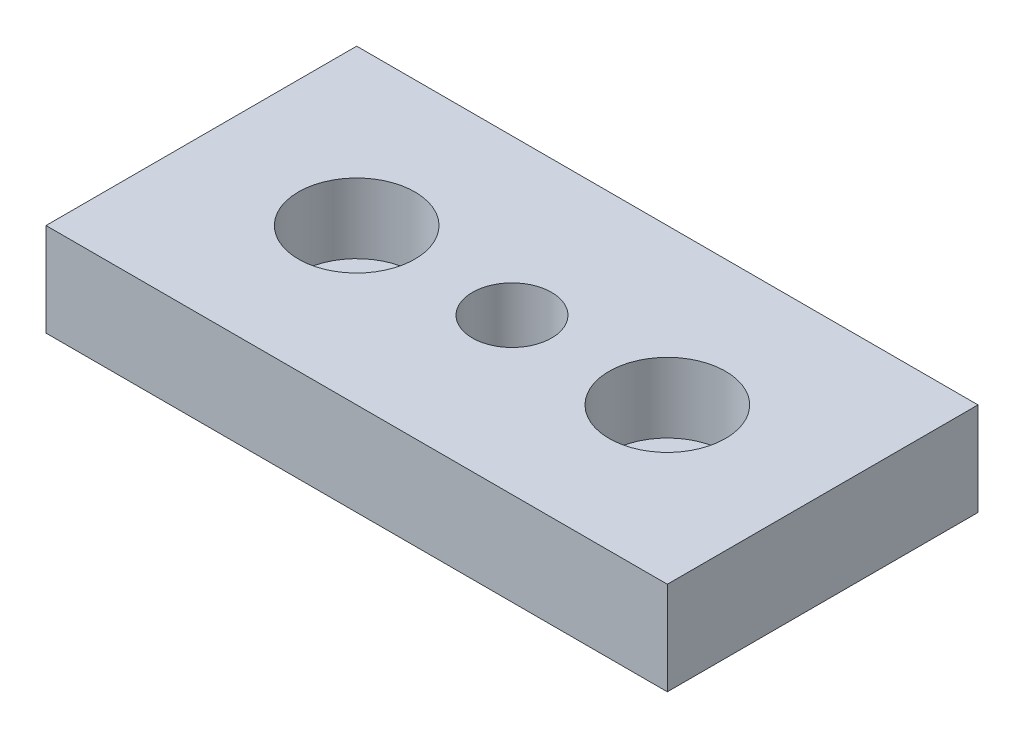
ISO-10303-21;
HEADER;
FILE_DESCRIPTION(('STEP AP214'),'2;1');
FILE_NAME('part.step','',(''),(''),'','','');
FILE_SCHEMA(('AUTOMOTIVE_DESIGN { 1 0 10303 214 1 1 1 1 }'));
ENDSEC;
DATA;
#1=APPLICATION_CONTEXT('core data for automotive mechanical design processes');
#2=APPLICATION_PROTOCOL_DEFINITION('international standard','automotive_design',2000,#1);
#3=PRODUCT_CONTEXT('',#1,'mechanical');
#4=PRODUCT('Part','Part','',(#3));
#5=PRODUCT_RELATED_PRODUCT_CATEGORY('part','',(#4));
#6=PRODUCT_DEFINITION_FORMATION('','',#4);
#7=PRODUCT_DEFINITION_CONTEXT('part definition',#1,'design');
#8=PRODUCT_DEFINITION('design','',#6,#7);
#9=PRODUCT_DEFINITION_SHAPE('','',#8);
#10=(LENGTH_UNIT() NAMED_UNIT(*) SI_UNIT(.MILLI.,.METRE.));
#11=(NAMED_UNIT(*) PLANE_ANGLE_UNIT() SI_UNIT($,.RADIAN.));
#12=(NAMED_UNIT(*) SI_UNIT($,.STERADIAN.) SOLID_ANGLE_UNIT());
#13=UNCERTAINTY_MEASURE_WITH_UNIT(LENGTH_MEASURE(1.E-05),#10,'distance_accuracy_value','');
#14=(GEOMETRIC_REPRESENTATION_CONTEXT(3) GLOBAL_UNCERTAINTY_ASSIGNED_CONTEXT((#13)) GLOBAL_UNIT_ASSIGNED_CONTEXT((#10,
#11,#12)) REPRESENTATION_CONTEXT('',''));
#15=CARTESIAN_POINT('',(0.,0.,0.));
#16=DIRECTION('',(0.,0.,1.));
#17=DIRECTION('',(1.,0.,0.));
#18=AXIS2_PLACEMENT_3D('',#15,#16,#17);
#19=CARTESIAN_POINT('',(40.,12.,20.));
#20=DIRECTION('',(-1.,0.,0.));
#21=DIRECTION('',(0.,0.,1.));
#22=AXIS2_PLACEMENT_3D('',#19,#20,#21);
#23=PLANE('',#22);
#24=DIRECTION('',(0.,0.,-1.));
#25=VECTOR('',#24,1.);
#26=CARTESIAN_POINT('',(40.,0.,20.));
#27=LINE('',#26,#25);
#28=CARTESIAN_POINT('',(40.,0.,20.));
#29=VERTEX_POINT('',#28);
#30=CARTESIAN_POINT('',(40.,0.,-20.));
#31=VERTEX_POINT('',#30);
#32=EDGE_CURVE('E100',#29,#31,#27,.T.);
#33=ORIENTED_EDGE('',*,*,#32,.T.);
#34=DIRECTION('',(0.,-1.,0.));
#35=VECTOR('',#34,1.);
#36=CARTESIAN_POINT('',(40.,12.,-20.));
#37=LINE('',#36,#35);
#38=CARTESIAN_POINT('',(40.,12.,-20.));
#39=VERTEX_POINT('',#38);
#40=EDGE_CURVE('E11',#39,#31,#37,.T.);
#41=ORIENTED_EDGE('',*,*,#40,.F.);
#42=DIRECTION('',(0.,0.,-1.));
#43=VECTOR('',#42,1.);
#44=CARTESIAN_POINT('',(40.,12.,20.));
#45=LINE('',#44,#43);
#46=CARTESIAN_POINT('',(40.,12.,20.));
#47=VERTEX_POINT('',#46);
#48=EDGE_CURVE('E88',#47,#39,#45,.T.);
#49=ORIENTED_EDGE('',*,*,#48,.F.);
#50=DIRECTION('',(0.,-1.,0.));
#51=VECTOR('',#50,1.);
#52=CARTESIAN_POINT('',(40.,12.,20.));
#53=LINE('',#52,#51);
#54=EDGE_CURVE('E96',#47,#29,#53,.T.);
#55=ORIENTED_EDGE('',*,*,#54,.T.);
#56=EDGE_LOOP('',(#33,#41,#49,#55));
#57=FACE_BOUND('',#56,.T.);
#58=ADVANCED_FACE('F37',(#57),#23,.F.);
#59=CARTESIAN_POINT('',(-40.,12.,-20.));
#60=DIRECTION('',(0.,0.,1.));
#61=DIRECTION('',(1.,0.,0.));
#62=AXIS2_PLACEMENT_3D('',#59,#60,#61);
#63=PLANE('',#62);
#64=DIRECTION('',(-1.,0.,0.));
#65=VECTOR('',#64,1.);
#66=CARTESIAN_POINT('',(-40.,0.,-20.));
#67=LINE('',#66,#65);
#68=CARTESIAN_POINT('',(-40.,0.,-20.));
#69=VERTEX_POINT('',#68);
#70=EDGE_CURVE('E92',#31,#69,#67,.T.);
#71=ORIENTED_EDGE('',*,*,#70,.T.);
#72=DIRECTION('',(0.,-1.,0.));
#73=VECTOR('',#72,1.);
#74=CARTESIAN_POINT('',(-40.,12.,-20.));
#75=LINE('',#74,#73);
#76=CARTESIAN_POINT('',(-40.,12.,-20.));
#77=VERTEX_POINT('',#76);
#78=EDGE_CURVE('E45',#77,#69,#75,.T.);
#79=ORIENTED_EDGE('',*,*,#78,.F.);
#80=DIRECTION('',(-1.,0.,0.));
#81=VECTOR('',#80,1.);
#82=CARTESIAN_POINT('',(-40.,12.,-20.));
#83=LINE('',#82,#81);
#84=EDGE_CURVE('E83',#39,#77,#83,.T.);
#85=ORIENTED_EDGE('',*,*,#84,.F.);
#86=ORIENTED_EDGE('',*,*,#40,.T.);
#87=EDGE_LOOP('',(#71,#79,#85,#86));
#88=FACE_BOUND('',#87,.T.);
#89=ADVANCED_FACE('F91',(#88),#63,.F.);
#90=CARTESIAN_POINT('',(-40.,12.,20.));
#91=DIRECTION('',(1.,0.,0.));
#92=DIRECTION('',(0.,0.,-1.));
#93=AXIS2_PLACEMENT_3D('',#90,#91,#92);
#94=PLANE('',#93);
#95=DIRECTION('',(0.,0.,1.));
#96=VECTOR('',#95,1.);
#97=CARTESIAN_POINT('',(-40.,0.,20.));
#98=LINE('',#97,#96);
#99=CARTESIAN_POINT('',(-40.,0.,20.));
#100=VERTEX_POINT('',#99);
#101=EDGE_CURVE('E70',#69,#100,#98,.T.);
#102=ORIENTED_EDGE('',*,*,#101,.T.);
#103=DIRECTION('',(0.,-1.,0.));
#104=VECTOR('',#103,1.);
#105=CARTESIAN_POINT('',(-40.,12.,20.));
#106=LINE('',#105,#104);
#107=CARTESIAN_POINT('',(-40.,12.,20.));
#108=VERTEX_POINT('',#107);
#109=EDGE_CURVE('E93',#108,#100,#106,.T.);
#110=ORIENTED_EDGE('',*,*,#109,.F.);
#111=DIRECTION('',(0.,0.,1.));
#112=VECTOR('',#111,1.);
#113=CARTESIAN_POINT('',(-40.,12.,20.));
#114=LINE('',#113,#112);
#115=EDGE_CURVE('E86',#77,#108,#114,.T.);
#116=ORIENTED_EDGE('',*,*,#115,.F.);
#117=ORIENTED_EDGE('',*,*,#78,.T.);
#118=EDGE_LOOP('',(#102,#110,#116,#117));
#119=FACE_BOUND('',#118,.T.);
#120=ADVANCED_FACE('F94',(#119),#94,.F.);
#121=CARTESIAN_POINT('',(-40.,12.,20.));
#122=DIRECTION('',(0.,0.,-1.));
#123=DIRECTION('',(-1.,0.,0.));
#124=AXIS2_PLACEMENT_3D('',#121,#122,#123);
#125=PLANE('',#124);
#126=DIRECTION('',(1.,0.,0.));
#127=VECTOR('',#126,1.);
#128=CARTESIAN_POINT('',(-40.,0.,20.));
#129=LINE('',#128,#127);
#130=EDGE_CURVE('E76',#100,#29,#129,.T.);
#131=ORIENTED_EDGE('',*,*,#130,.T.);
#132=ORIENTED_EDGE('',*,*,#54,.F.);
#133=DIRECTION('',(1.,0.,0.));
#134=VECTOR('',#133,1.);
#135=CARTESIAN_POINT('',(-40.,12.,20.));
#136=LINE('',#135,#134);
#137=EDGE_CURVE('E53',#108,#47,#136,.T.);
#138=ORIENTED_EDGE('',*,*,#137,.F.);
#139=ORIENTED_EDGE('',*,*,#109,.T.);
#140=EDGE_LOOP('',(#131,#132,#138,#139));
#141=FACE_BOUND('',#140,.T.);
#142=ADVANCED_FACE('F108',(#141),#125,.F.);
#143=CARTESIAN_POINT('',(0.,12.,0.));
#144=DIRECTION('',(0.,-1.,0.));
#145=DIRECTION('',(0.,0.,-1.));
#146=AXIS2_PLACEMENT_3D('',#143,#144,#145);
#147=PLANE('',#146);
#148=CARTESIAN_POINT('',(0.,12.,0.));
#149=DIRECTION('',(0.,1.,0.));
#150=DIRECTION('',(0.,0.,1.));
#151=AXIS2_PLACEMENT_3D('',#148,#149,#150);
#152=CIRCLE('',#151,5.1);
#153=CARTESIAN_POINT('',(0.,12.,5.1));
#154=VERTEX_POINT('',#153);
#155=EDGE_CURVE('E140',#154,#154,#152,.T.);
#156=ORIENTED_EDGE('',*,*,#155,.F.);
#157=EDGE_LOOP('',(#156));
#158=FACE_BOUND('',#157,.T.);
#159=CARTESIAN_POINT('',(20.,12.,0.));
#160=DIRECTION('',(0.,-1.,0.));
#161=DIRECTION('',(1.,0.,0.));
#162=AXIS2_PLACEMENT_3D('',#159,#160,#161);
#163=CIRCLE('',#162,7.5);
#164=CARTESIAN_POINT('',(27.5,12.,0.));
#165=VERTEX_POINT('',#164);
#166=EDGE_CURVE('E125',#165,#165,#163,.T.);
#167=ORIENTED_EDGE('',*,*,#166,.T.);
#168=EDGE_LOOP('',(#167));
#169=FACE_BOUND('',#168,.T.);
#170=CARTESIAN_POINT('',(-20.,12.,0.));
#171=DIRECTION('',(0.,1.,0.));
#172=DIRECTION('',(-1.,0.,0.));
#173=AXIS2_PLACEMENT_3D('',#170,#171,#172);
#174=CIRCLE('',#173,7.5);
#175=CARTESIAN_POINT('',(-27.5,12.,0.));
#176=VERTEX_POINT('',#175);
#177=EDGE_CURVE('E103',#176,#176,#174,.T.);
#178=ORIENTED_EDGE('',*,*,#177,.F.);
#179=EDGE_LOOP('',(#178));
#180=FACE_BOUND('',#179,.T.);
#181=ORIENTED_EDGE('',*,*,#48,.T.);
#182=ORIENTED_EDGE('',*,*,#84,.T.);
#183=ORIENTED_EDGE('',*,*,#115,.T.);
#184=ORIENTED_EDGE('',*,*,#137,.T.);
#185=EDGE_LOOP('',(#181,#182,#183,#184));
#186=FACE_BOUND('',#185,.T.);
#187=ADVANCED_FACE('F84',(#158,#169,#180,#186),#147,.F.);
#188=CARTESIAN_POINT('',(0.,0.,0.));
#189=DIRECTION('',(0.,-1.,0.));
#190=DIRECTION('',(0.,0.,-1.));
#191=AXIS2_PLACEMENT_3D('',#188,#189,#190);
#192=PLANE('',#191);
#193=CARTESIAN_POINT('',(0.,0.,0.));
#194=DIRECTION('',(0.,-1.,0.));
#195=DIRECTION('',(0.,0.,-1.));
#196=AXIS2_PLACEMENT_3D('',#193,#194,#195);
#197=CIRCLE('',#196,5.1);
#198=CARTESIAN_POINT('',(0.,0.,-5.1));
#199=VERTEX_POINT('',#198);
#200=EDGE_CURVE('E137',#199,#199,#197,.T.);
#201=ORIENTED_EDGE('',*,*,#200,.F.);
#202=EDGE_LOOP('',(#201));
#203=FACE_BOUND('',#202,.T.);
#204=CARTESIAN_POINT('',(20.,0.,0.));
#205=DIRECTION('',(0.,-1.,0.));
#206=DIRECTION('',(1.,0.,0.));
#207=AXIS2_PLACEMENT_3D('',#204,#205,#206);
#208=CIRCLE('',#207,4.5);
#209=CARTESIAN_POINT('',(24.5,0.,0.));
#210=VERTEX_POINT('',#209);
#211=EDGE_CURVE('E134',#210,#210,#208,.T.);
#212=ORIENTED_EDGE('',*,*,#211,.F.);
#213=EDGE_LOOP('',(#212));
#214=FACE_BOUND('',#213,.T.);
#215=CARTESIAN_POINT('',(-20.,0.,0.));
#216=DIRECTION('',(0.,1.,0.));
#217=DIRECTION('',(-1.,0.,0.));
#218=AXIS2_PLACEMENT_3D('',#215,#216,#217);
#219=CIRCLE('',#218,4.5);
#220=CARTESIAN_POINT('',(-24.5,0.,0.));
#221=VERTEX_POINT('',#220);
#222=EDGE_CURVE('E122',#221,#221,#219,.T.);
#223=ORIENTED_EDGE('',*,*,#222,.T.);
#224=EDGE_LOOP('',(#223));
#225=FACE_BOUND('',#224,.T.);
#226=ORIENTED_EDGE('',*,*,#32,.F.);
#227=ORIENTED_EDGE('',*,*,#130,.F.);
#228=ORIENTED_EDGE('',*,*,#101,.F.);
#229=ORIENTED_EDGE('',*,*,#70,.F.);
#230=EDGE_LOOP('',(#226,#227,#228,#229));
#231=FACE_BOUND('',#230,.T.);
#232=ADVANCED_FACE('F111',(#203,#214,#225,#231),#192,.T.);
#233=CARTESIAN_POINT('',(-20.,12.,0.));
#234=DIRECTION('',(0.,1.,0.));
#235=DIRECTION('',(-1.,0.,0.));
#236=AXIS2_PLACEMENT_3D('',#233,#234,#235);
#237=CYLINDRICAL_SURFACE('',#236,7.5);
#238=CARTESIAN_POINT('',(-20.,3.,0.));
#239=DIRECTION('',(0.,1.,0.));
#240=DIRECTION('',(-1.,0.,0.));
#241=AXIS2_PLACEMENT_3D('',#238,#239,#240);
#242=CIRCLE('',#241,7.5);
#243=CARTESIAN_POINT('',(-27.5,3.,0.));
#244=VERTEX_POINT('',#243);
#245=EDGE_CURVE('E116',#244,#244,#242,.T.);
#246=ORIENTED_EDGE('',*,*,#245,.F.);
#247=EDGE_LOOP('',(#246));
#248=FACE_BOUND('',#247,.T.);
#249=ORIENTED_EDGE('',*,*,#177,.T.);
#250=EDGE_LOOP('',(#249));
#251=FACE_BOUND('',#250,.T.);
#252=ADVANCED_FACE('F154',(#248,#251),#237,.F.);
#253=CARTESIAN_POINT('',(-27.5,3.,0.));
#254=DIRECTION('',(0.,-1.,0.));
#255=DIRECTION('',(1.,0.,0.));
#256=AXIS2_PLACEMENT_3D('',#253,#254,#255);
#257=PLANE('',#256);
#258=CARTESIAN_POINT('',(-20.,3.,0.));
#259=DIRECTION('',(0.,1.,0.));
#260=DIRECTION('',(-1.,0.,0.));
#261=AXIS2_PLACEMENT_3D('',#258,#259,#260);
#262=CIRCLE('',#261,4.5);
#263=CARTESIAN_POINT('',(-24.5,3.,0.));
#264=VERTEX_POINT('',#263);
#265=EDGE_CURVE('E119',#264,#264,#262,.T.);
#266=ORIENTED_EDGE('',*,*,#265,.F.);
#267=EDGE_LOOP('',(#266));
#268=FACE_BOUND('',#267,.T.);
#269=ORIENTED_EDGE('',*,*,#245,.T.);
#270=EDGE_LOOP('',(#269));
#271=FACE_BOUND('',#270,.T.);
#272=ADVANCED_FACE('F156',(#268,#271),#257,.F.);
#273=CARTESIAN_POINT('',(-20.,12.,0.));
#274=DIRECTION('',(0.,1.,0.));
#275=DIRECTION('',(-1.,0.,0.));
#276=AXIS2_PLACEMENT_3D('',#273,#274,#275);
#277=CYLINDRICAL_SURFACE('',#276,4.5);
#278=ORIENTED_EDGE('',*,*,#222,.F.);
#279=EDGE_LOOP('',(#278));
#280=FACE_BOUND('',#279,.T.);
#281=ORIENTED_EDGE('',*,*,#265,.T.);
#282=EDGE_LOOP('',(#281));
#283=FACE_BOUND('',#282,.T.);
#284=ADVANCED_FACE('F163',(#280,#283),#277,.F.);
#285=CARTESIAN_POINT('',(20.,12.,0.));
#286=DIRECTION('',(0.,1.,0.));
#287=DIRECTION('',(1.,0.,0.));
#288=AXIS2_PLACEMENT_3D('',#285,#286,#287);
#289=CYLINDRICAL_SURFACE('',#288,7.5);
#290=CARTESIAN_POINT('',(20.,3.,0.));
#291=DIRECTION('',(0.,-1.,0.));
#292=DIRECTION('',(1.,0.,0.));
#293=AXIS2_PLACEMENT_3D('',#290,#291,#292);
#294=CIRCLE('',#293,7.5);
#295=CARTESIAN_POINT('',(27.5,3.,0.));
#296=VERTEX_POINT('',#295);
#297=EDGE_CURVE('E128',#296,#296,#294,.T.);
#298=ORIENTED_EDGE('',*,*,#297,.T.);
#299=EDGE_LOOP('',(#298));
#300=FACE_BOUND('',#299,.T.);
#301=ORIENTED_EDGE('',*,*,#166,.F.);
#302=EDGE_LOOP('',(#301));
#303=FACE_BOUND('',#302,.T.);
#304=ADVANCED_FACE('F219',(#300,#303),#289,.F.);
#305=CARTESIAN_POINT('',(27.5,3.,0.));
#306=DIRECTION('',(0.,-1.,0.));
#307=DIRECTION('',(-1.,0.,0.));
#308=AXIS2_PLACEMENT_3D('',#305,#306,#307);
#309=PLANE('',#308);
#310=CARTESIAN_POINT('',(20.,3.,0.));
#311=DIRECTION('',(0.,-1.,0.));
#312=DIRECTION('',(1.,0.,0.));
#313=AXIS2_PLACEMENT_3D('',#310,#311,#312);
#314=CIRCLE('',#313,4.5);
#315=CARTESIAN_POINT('',(24.5,3.,0.));
#316=VERTEX_POINT('',#315);
#317=EDGE_CURVE('E131',#316,#316,#314,.T.);
#318=ORIENTED_EDGE('',*,*,#317,.T.);
#319=EDGE_LOOP('',(#318));
#320=FACE_BOUND('',#319,.T.);
#321=ORIENTED_EDGE('',*,*,#297,.F.);
#322=EDGE_LOOP('',(#321));
#323=FACE_BOUND('',#322,.T.);
#324=ADVANCED_FACE('F212',(#320,#323),#309,.F.);
#325=CARTESIAN_POINT('',(20.,12.,0.));
#326=DIRECTION('',(0.,1.,0.));
#327=DIRECTION('',(1.,0.,0.));
#328=AXIS2_PLACEMENT_3D('',#325,#326,#327);
#329=CYLINDRICAL_SURFACE('',#328,4.5);
#330=ORIENTED_EDGE('',*,*,#211,.T.);
#331=EDGE_LOOP('',(#330));
#332=FACE_BOUND('',#331,.T.);
#333=ORIENTED_EDGE('',*,*,#317,.F.);
#334=EDGE_LOOP('',(#333));
#335=FACE_BOUND('',#334,.T.);
#336=ADVANCED_FACE('F202',(#332,#335),#329,.F.);
#337=CARTESIAN_POINT('',(0.,12.,0.));
#338=DIRECTION('',(0.,1.,0.));
#339=DIRECTION('',(0.,0.,1.));
#340=AXIS2_PLACEMENT_3D('',#337,#338,#339);
#341=CYLINDRICAL_SURFACE('',#340,5.1);
#342=ORIENTED_EDGE('',*,*,#155,.T.);
#343=EDGE_LOOP('',(#342));
#344=FACE_BOUND('',#343,.T.);
#345=ORIENTED_EDGE('',*,*,#200,.T.);
#346=EDGE_LOOP('',(#345));
#347=FACE_BOUND('',#346,.T.);
#348=ADVANCED_FACE('F144',(#344,#347),#341,.F.);
#349=CLOSED_SHELL('',(#58,#89,#120,#142,#187,#232,#252,#272,#284,#304,#324,#336,#348));
#350=MANIFOLD_SOLID_BREP('B2',#349);
#351=ADVANCED_BREP_SHAPE_REPRESENTATION('',(#18,#350),#14);
#352=SHAPE_DEFINITION_REPRESENTATION(#9,#351);
ENDSEC;
END-ISO-10303-21;
